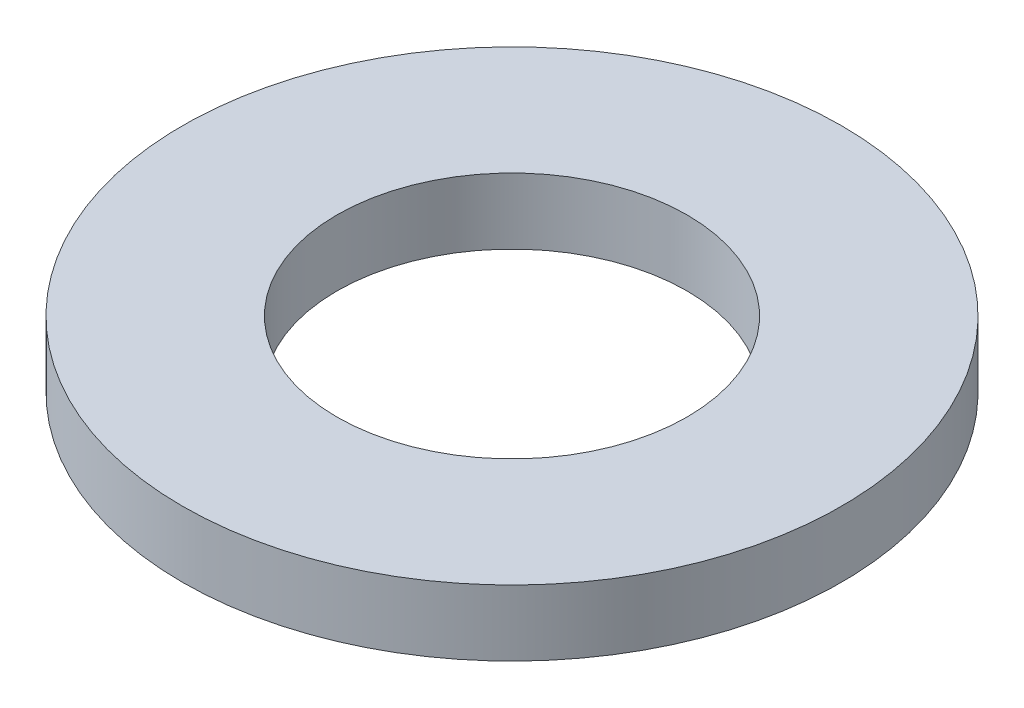
ISO-10303-21;
HEADER;
FILE_DESCRIPTION(('STEP AP214'),'2;1');
FILE_NAME('part.step','',(''),(''),'','','');
FILE_SCHEMA(('AUTOMOTIVE_DESIGN { 1 0 10303 214 1 1 1 1 }'));
ENDSEC;
DATA;
#1=APPLICATION_CONTEXT('core data for automotive mechanical design processes');
#2=APPLICATION_PROTOCOL_DEFINITION('international standard','automotive_design',2000,#1);
#3=PRODUCT_CONTEXT('',#1,'mechanical');
#4=PRODUCT('Part','Part','',(#3));
#5=PRODUCT_RELATED_PRODUCT_CATEGORY('part','',(#4));
#6=PRODUCT_DEFINITION_FORMATION('','',#4);
#7=PRODUCT_DEFINITION_CONTEXT('part definition',#1,'design');
#8=PRODUCT_DEFINITION('design','',#6,#7);
#9=PRODUCT_DEFINITION_SHAPE('','',#8);
#10=(LENGTH_UNIT() NAMED_UNIT(*) SI_UNIT(.MILLI.,.METRE.));
#11=(NAMED_UNIT(*) PLANE_ANGLE_UNIT() SI_UNIT($,.RADIAN.));
#12=(NAMED_UNIT(*) SI_UNIT($,.STERADIAN.) SOLID_ANGLE_UNIT());
#13=UNCERTAINTY_MEASURE_WITH_UNIT(LENGTH_MEASURE(1.E-05),#10,'distance_accuracy_value','');
#14=(GEOMETRIC_REPRESENTATION_CONTEXT(3) GLOBAL_UNCERTAINTY_ASSIGNED_CONTEXT((#13)) GLOBAL_UNIT_ASSIGNED_CONTEXT((#10,
#11,#12)) REPRESENTATION_CONTEXT('',''));
#15=CARTESIAN_POINT('',(0.,0.,0.));
#16=DIRECTION('',(0.,0.,1.));
#17=DIRECTION('',(1.,0.,0.));
#18=AXIS2_PLACEMENT_3D('',#15,#16,#17);
#19=CARTESIAN_POINT('',(0.,1.27,0.));
#20=DIRECTION('',(0.,1.,0.));
#21=DIRECTION('',(0.,0.,1.));
#22=AXIS2_PLACEMENT_3D('',#19,#20,#21);
#23=PLANE('',#22);
#24=CARTESIAN_POINT('',(0.,1.27,0.));
#25=DIRECTION('',(0.,1.,0.));
#26=DIRECTION('',(0.,0.,1.));
#27=AXIS2_PLACEMENT_3D('',#24,#25,#26);
#28=CIRCLE('',#27,6.35);
#29=CARTESIAN_POINT('',(0.,1.27,6.35));
#30=VERTEX_POINT('',#29);
#31=EDGE_CURVE('E10',#30,#30,#28,.T.);
#32=ORIENTED_EDGE('',*,*,#31,.T.);
#33=EDGE_LOOP('',(#32));
#34=FACE_BOUND('',#33,.T.);
#35=CARTESIAN_POINT('',(0.,1.27,0.));
#36=DIRECTION('',(0.,1.,0.));
#37=DIRECTION('',(0.,0.,1.));
#38=AXIS2_PLACEMENT_3D('',#35,#36,#37);
#39=CIRCLE('',#38,3.3734375);
#40=CARTESIAN_POINT('',(0.,1.27,3.3734375));
#41=VERTEX_POINT('',#40);
#42=EDGE_CURVE('E42',#41,#41,#39,.T.);
#43=ORIENTED_EDGE('',*,*,#42,.F.);
#44=EDGE_LOOP('',(#43));
#45=FACE_BOUND('',#44,.T.);
#46=ADVANCED_FACE('F31',(#34,#45),#23,.T.);
#47=CARTESIAN_POINT('',(0.,0.,0.));
#48=DIRECTION('',(0.,1.,0.));
#49=DIRECTION('',(0.,0.,1.));
#50=AXIS2_PLACEMENT_3D('',#47,#48,#49);
#51=PLANE('',#50);
#52=CARTESIAN_POINT('',(0.,0.,0.));
#53=DIRECTION('',(0.,1.,0.));
#54=DIRECTION('',(0.,0.,1.));
#55=AXIS2_PLACEMENT_3D('',#52,#53,#54);
#56=CIRCLE('',#55,6.35);
#57=CARTESIAN_POINT('',(0.,0.,6.35));
#58=VERTEX_POINT('',#57);
#59=EDGE_CURVE('E35',#58,#58,#56,.T.);
#60=ORIENTED_EDGE('',*,*,#59,.F.);
#61=EDGE_LOOP('',(#60));
#62=FACE_BOUND('',#61,.T.);
#63=CARTESIAN_POINT('',(0.,0.,0.));
#64=DIRECTION('',(0.,1.,0.));
#65=DIRECTION('',(0.,0.,1.));
#66=AXIS2_PLACEMENT_3D('',#63,#64,#65);
#67=CIRCLE('',#66,3.3734375);
#68=CARTESIAN_POINT('',(0.,0.,3.3734375));
#69=VERTEX_POINT('',#68);
#70=EDGE_CURVE('E44',#69,#69,#67,.T.);
#71=ORIENTED_EDGE('',*,*,#70,.T.);
#72=EDGE_LOOP('',(#71));
#73=FACE_BOUND('',#72,.T.);
#74=ADVANCED_FACE('F54',(#62,#73),#51,.F.);
#75=CARTESIAN_POINT('',(0.,1.27,0.));
#76=DIRECTION('',(0.,-1.,0.));
#77=DIRECTION('',(0.,0.,-1.));
#78=AXIS2_PLACEMENT_3D('',#75,#76,#77);
#79=CYLINDRICAL_SURFACE('',#78,6.35);
#80=ORIENTED_EDGE('',*,*,#31,.F.);
#81=EDGE_LOOP('',(#80));
#82=FACE_BOUND('',#81,.T.);
#83=ORIENTED_EDGE('',*,*,#59,.T.);
#84=EDGE_LOOP('',(#83));
#85=FACE_BOUND('',#84,.T.);
#86=ADVANCED_FACE('F33',(#82,#85),#79,.T.);
#87=CARTESIAN_POINT('',(0.,1.27,0.));
#88=DIRECTION('',(0.,-1.,0.));
#89=DIRECTION('',(0.,0.,-1.));
#90=AXIS2_PLACEMENT_3D('',#87,#88,#89);
#91=CYLINDRICAL_SURFACE('',#90,3.3734375);
#92=ORIENTED_EDGE('',*,*,#42,.T.);
#93=EDGE_LOOP('',(#92));
#94=FACE_BOUND('',#93,.T.);
#95=ORIENTED_EDGE('',*,*,#70,.F.);
#96=EDGE_LOOP('',(#95));
#97=FACE_BOUND('',#96,.T.);
#98=ADVANCED_FACE('F50',(#94,#97),#91,.F.);
#99=CLOSED_SHELL('',(#46,#74,#86,#98));
#100=MANIFOLD_SOLID_BREP('B2',#99);
#101=ADVANCED_BREP_SHAPE_REPRESENTATION('',(#18,#100),#14);
#102=SHAPE_DEFINITION_REPRESENTATION(#9,#101);
ENDSEC;
END-ISO-10303-21;
